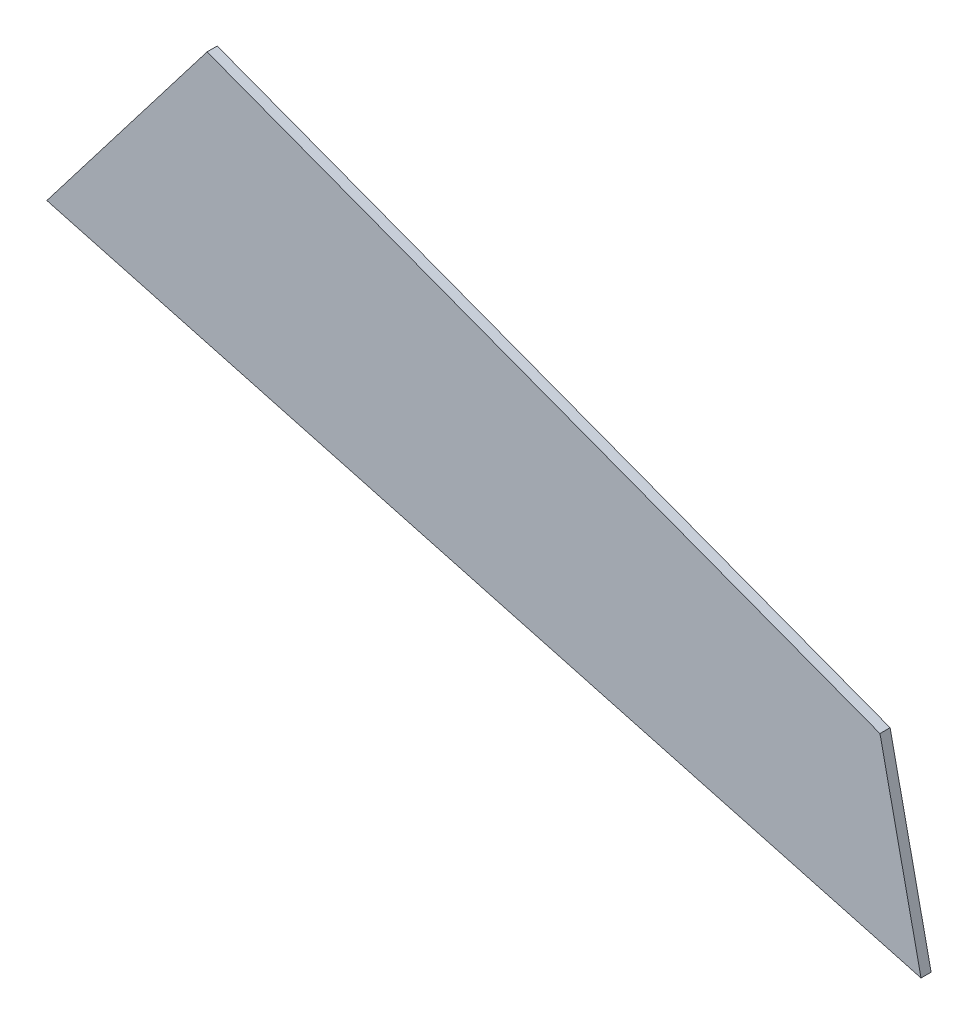
ISO-10303-21;
HEADER;
FILE_DESCRIPTION(('STEP AP214'),'2;1');
FILE_NAME('part.step','',(''),(''),'','','');
FILE_SCHEMA(('AUTOMOTIVE_DESIGN { 1 0 10303 214 1 1 1 1 }'));
ENDSEC;
DATA;
#1=APPLICATION_CONTEXT('core data for automotive mechanical design processes');
#2=APPLICATION_PROTOCOL_DEFINITION('international standard','automotive_design',2000,#1);
#3=PRODUCT_CONTEXT('',#1,'mechanical');
#4=PRODUCT('Part','Part','',(#3));
#5=PRODUCT_RELATED_PRODUCT_CATEGORY('part','',(#4));
#6=PRODUCT_DEFINITION_FORMATION('','',#4);
#7=PRODUCT_DEFINITION_CONTEXT('part definition',#1,'design');
#8=PRODUCT_DEFINITION('design','',#6,#7);
#9=PRODUCT_DEFINITION_SHAPE('','',#8);
#10=(LENGTH_UNIT() NAMED_UNIT(*) SI_UNIT(.MILLI.,.METRE.));
#11=(NAMED_UNIT(*) PLANE_ANGLE_UNIT() SI_UNIT($,.RADIAN.));
#12=(NAMED_UNIT(*) SI_UNIT($,.STERADIAN.) SOLID_ANGLE_UNIT());
#13=UNCERTAINTY_MEASURE_WITH_UNIT(LENGTH_MEASURE(1.E-05),#10,'distance_accuracy_value','');
#14=(GEOMETRIC_REPRESENTATION_CONTEXT(3) GLOBAL_UNCERTAINTY_ASSIGNED_CONTEXT((#13)) GLOBAL_UNIT_ASSIGNED_CONTEXT((#10,
#11,#12)) REPRESENTATION_CONTEXT('',''));
#15=CARTESIAN_POINT('',(0.,0.,0.));
#16=DIRECTION('',(0.,0.,1.));
#17=DIRECTION('',(1.,0.,0.));
#18=AXIS2_PLACEMENT_3D('',#15,#16,#17);
#19=CARTESIAN_POINT('',(-225.340182798139,-20.1065922266043,3.));
#20=DIRECTION('',(0.260888648920558,0.965368899884601,0.));
#21=DIRECTION('',(-0.965368899884602,0.260888648920558,0.));
#22=AXIS2_PLACEMENT_3D('',#19,#20,#21);
#23=PLANE('',#22);
#24=DIRECTION('',(0.965368899884602,-0.260888648920558,0.));
#25=VECTOR('',#24,1.);
#26=CARTESIAN_POINT('',(-225.340182798139,-20.1065922266043,0.));
#27=LINE('',#26,#25);
#28=CARTESIAN_POINT('',(-484.489325306806,49.927847111652,0.));
#29=VERTEX_POINT('',#28);
#30=CARTESIAN_POINT('',(-225.340182798139,-20.1065922266043,0.));
#31=VERTEX_POINT('',#30);
#32=EDGE_CURVE('E96',#29,#31,#27,.T.);
#33=ORIENTED_EDGE('',*,*,#32,.T.);
#34=DIRECTION('',(0.,0.,-1.));
#35=VECTOR('',#34,1.);
#36=CARTESIAN_POINT('',(-225.340182798139,-20.1065922266043,3.));
#37=LINE('',#36,#35);
#38=CARTESIAN_POINT('',(-225.340182798139,-20.1065922266043,3.));
#39=VERTEX_POINT('',#38);
#40=EDGE_CURVE('E11',#39,#31,#37,.T.);
#41=ORIENTED_EDGE('',*,*,#40,.F.);
#42=DIRECTION('',(0.965368899884602,-0.260888648920558,0.));
#43=VECTOR('',#42,1.);
#44=CARTESIAN_POINT('',(-225.340182798139,-20.1065922266043,3.));
#45=LINE('',#44,#43);
#46=CARTESIAN_POINT('',(-484.489325306806,49.927847111652,3.));
#47=VERTEX_POINT('',#46);
#48=EDGE_CURVE('E84',#47,#39,#45,.T.);
#49=ORIENTED_EDGE('',*,*,#48,.F.);
#50=DIRECTION('',(0.,0.,-1.));
#51=VECTOR('',#50,1.);
#52=CARTESIAN_POINT('',(-484.489325306806,49.927847111652,3.));
#53=LINE('',#52,#51);
#54=EDGE_CURVE('E92',#47,#29,#53,.T.);
#55=ORIENTED_EDGE('',*,*,#54,.T.);
#56=EDGE_LOOP('',(#33,#41,#49,#55));
#57=FACE_BOUND('',#56,.T.);
#58=ADVANCED_FACE('F33',(#57),#23,.F.);
#59=CARTESIAN_POINT('',(-237.514047493738,36.5694271397239,3.));
#60=DIRECTION('',(-0.97769979076263,-0.21000742639895,0.));
#61=DIRECTION('',(0.21000742639895,-0.97769979076263,0.));
#62=AXIS2_PLACEMENT_3D('',#59,#60,#61);
#63=PLANE('',#62);
#64=DIRECTION('',(-0.21000742639895,0.97769979076263,0.));
#65=VECTOR('',#64,1.);
#66=CARTESIAN_POINT('',(-237.514047493738,36.5694271397239,0.));
#67=LINE('',#66,#65);
#68=CARTESIAN_POINT('',(-237.514047493738,36.5694271397239,0.));
#69=VERTEX_POINT('',#68);
#70=EDGE_CURVE('E88',#31,#69,#67,.T.);
#71=ORIENTED_EDGE('',*,*,#70,.T.);
#72=DIRECTION('',(0.,0.,-1.));
#73=VECTOR('',#72,1.);
#74=CARTESIAN_POINT('',(-237.514047493738,36.5694271397239,3.));
#75=LINE('',#74,#73);
#76=CARTESIAN_POINT('',(-237.514047493738,36.5694271397239,3.));
#77=VERTEX_POINT('',#76);
#78=EDGE_CURVE('E41',#77,#69,#75,.T.);
#79=ORIENTED_EDGE('',*,*,#78,.F.);
#80=DIRECTION('',(-0.21000742639895,0.97769979076263,0.));
#81=VECTOR('',#80,1.);
#82=CARTESIAN_POINT('',(-237.514047493738,36.5694271397239,3.));
#83=LINE('',#82,#81);
#84=EDGE_CURVE('E79',#39,#77,#83,.T.);
#85=ORIENTED_EDGE('',*,*,#84,.F.);
#86=ORIENTED_EDGE('',*,*,#40,.T.);
#87=EDGE_LOOP('',(#71,#79,#85,#86));
#88=FACE_BOUND('',#87,.T.);
#89=ADVANCED_FACE('F87',(#88),#63,.F.);
#90=CARTESIAN_POINT('',(-436.988244516613,111.846536807576,3.));
#91=DIRECTION('',(-0.353072967937326,-0.935595788421436,0.));
#92=DIRECTION('',(0.935595788421436,-0.353072967937326,0.));
#93=AXIS2_PLACEMENT_3D('',#90,#91,#92);
#94=PLANE('',#93);
#95=DIRECTION('',(-0.935595788421436,0.353072967937326,0.));
#96=VECTOR('',#95,1.);
#97=CARTESIAN_POINT('',(-436.988244516613,111.846536807576,0.));
#98=LINE('',#97,#96);
#99=CARTESIAN_POINT('',(-436.988244516613,111.846536807576,0.));
#100=VERTEX_POINT('',#99);
#101=EDGE_CURVE('E66',#69,#100,#98,.T.);
#102=ORIENTED_EDGE('',*,*,#101,.T.);
#103=DIRECTION('',(0.,0.,-1.));
#104=VECTOR('',#103,1.);
#105=CARTESIAN_POINT('',(-436.988244516613,111.846536807576,3.));
#106=LINE('',#105,#104);
#107=CARTESIAN_POINT('',(-436.988244516613,111.846536807576,3.));
#108=VERTEX_POINT('',#107);
#109=EDGE_CURVE('E89',#108,#100,#106,.T.);
#110=ORIENTED_EDGE('',*,*,#109,.F.);
#111=DIRECTION('',(-0.935595788421436,0.353072967937326,0.));
#112=VECTOR('',#111,1.);
#113=CARTESIAN_POINT('',(-436.988244516613,111.846536807576,3.));
#114=LINE('',#113,#112);
#115=EDGE_CURVE('E82',#77,#108,#114,.T.);
#116=ORIENTED_EDGE('',*,*,#115,.F.);
#117=ORIENTED_EDGE('',*,*,#78,.T.);
#118=EDGE_LOOP('',(#102,#110,#116,#117));
#119=FACE_BOUND('',#118,.T.);
#120=ADVANCED_FACE('F90',(#119),#94,.F.);
#121=CARTESIAN_POINT('',(-484.489325306806,49.927847111652,3.));
#122=DIRECTION('',(0.793420178235436,-0.60867431420165,0.));
#123=DIRECTION('',(0.60867431420165,0.793420178235436,0.));
#124=AXIS2_PLACEMENT_3D('',#121,#122,#123);
#125=PLANE('',#124);
#126=DIRECTION('',(-0.60867431420165,-0.793420178235436,0.));
#127=VECTOR('',#126,1.);
#128=CARTESIAN_POINT('',(-484.489325306806,49.927847111652,0.));
#129=LINE('',#128,#127);
#130=EDGE_CURVE('E72',#100,#29,#129,.T.);
#131=ORIENTED_EDGE('',*,*,#130,.T.);
#132=ORIENTED_EDGE('',*,*,#54,.F.);
#133=DIRECTION('',(-0.60867431420165,-0.793420178235436,0.));
#134=VECTOR('',#133,1.);
#135=CARTESIAN_POINT('',(-484.489325306806,49.927847111652,3.));
#136=LINE('',#135,#134);
#137=EDGE_CURVE('E49',#108,#47,#136,.T.);
#138=ORIENTED_EDGE('',*,*,#137,.F.);
#139=ORIENTED_EDGE('',*,*,#109,.T.);
#140=EDGE_LOOP('',(#131,#132,#138,#139));
#141=FACE_BOUND('',#140,.T.);
#142=ADVANCED_FACE('F103',(#141),#125,.F.);
#143=CARTESIAN_POINT('',(0.,0.,3.));
#144=DIRECTION('',(0.,0.,-1.));
#145=DIRECTION('',(-1.,0.,0.));
#146=AXIS2_PLACEMENT_3D('',#143,#144,#145);
#147=PLANE('',#146);
#148=ORIENTED_EDGE('',*,*,#48,.T.);
#149=ORIENTED_EDGE('',*,*,#84,.T.);
#150=ORIENTED_EDGE('',*,*,#115,.T.);
#151=ORIENTED_EDGE('',*,*,#137,.T.);
#152=EDGE_LOOP('',(#148,#149,#150,#151));
#153=FACE_BOUND('',#152,.T.);
#154=ADVANCED_FACE('F80',(#153),#147,.F.);
#155=CARTESIAN_POINT('',(0.,0.,0.));
#156=DIRECTION('',(0.,0.,-1.));
#157=DIRECTION('',(-1.,0.,0.));
#158=AXIS2_PLACEMENT_3D('',#155,#156,#157);
#159=PLANE('',#158);
#160=ORIENTED_EDGE('',*,*,#32,.F.);
#161=ORIENTED_EDGE('',*,*,#130,.F.);
#162=ORIENTED_EDGE('',*,*,#101,.F.);
#163=ORIENTED_EDGE('',*,*,#70,.F.);
#164=EDGE_LOOP('',(#160,#161,#162,#163));
#165=FACE_BOUND('',#164,.T.);
#166=ADVANCED_FACE('F106',(#165),#159,.T.);
#167=CLOSED_SHELL('',(#58,#89,#120,#142,#154,#166));
#168=MANIFOLD_SOLID_BREP('B2',#167);
#169=ADVANCED_BREP_SHAPE_REPRESENTATION('',(#18,#168),#14);
#170=SHAPE_DEFINITION_REPRESENTATION(#9,#169);
ENDSEC;
END-ISO-10303-21;
